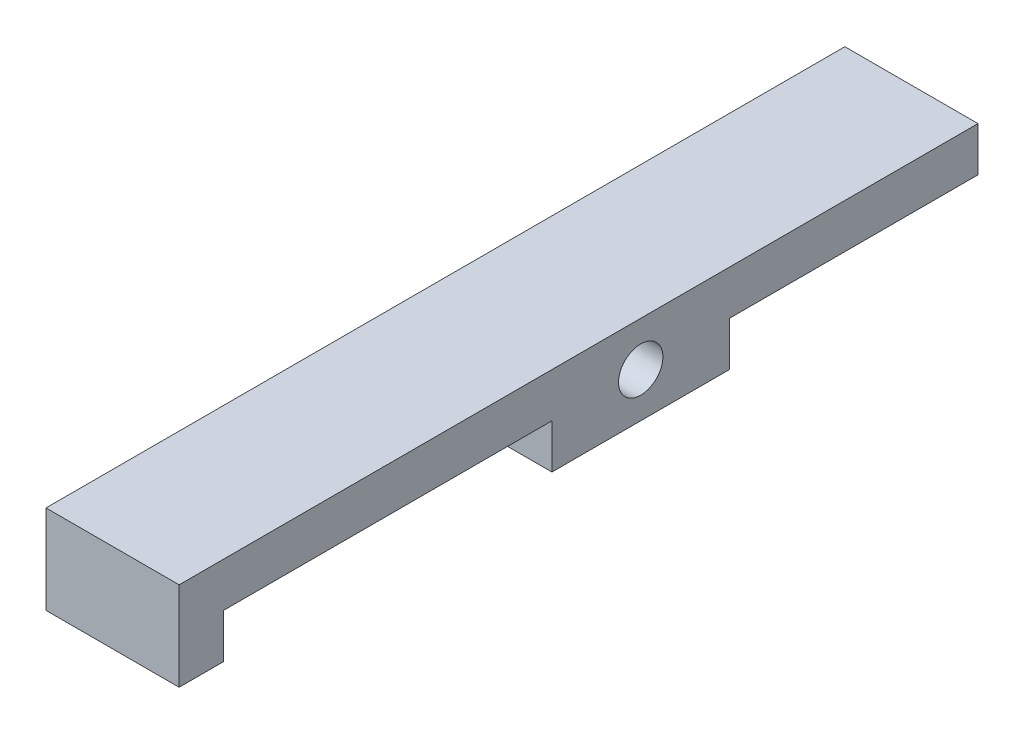
ISO-10303-21;
HEADER;
FILE_DESCRIPTION(('STEP AP214'),'2;1');
FILE_NAME('part.step','',(''),(''),'','','');
FILE_SCHEMA(('AUTOMOTIVE_DESIGN { 1 0 10303 214 1 1 1 1 }'));
ENDSEC;
DATA;
#1=APPLICATION_CONTEXT('core data for automotive mechanical design processes');
#2=APPLICATION_PROTOCOL_DEFINITION('international standard','automotive_design',2000,#1);
#3=PRODUCT_CONTEXT('',#1,'mechanical');
#4=PRODUCT('Part','Part','',(#3));
#5=PRODUCT_RELATED_PRODUCT_CATEGORY('part','',(#4));
#6=PRODUCT_DEFINITION_FORMATION('','',#4);
#7=PRODUCT_DEFINITION_CONTEXT('part definition',#1,'design');
#8=PRODUCT_DEFINITION('design','',#6,#7);
#9=PRODUCT_DEFINITION_SHAPE('','',#8);
#10=(LENGTH_UNIT() NAMED_UNIT(*) SI_UNIT(.MILLI.,.METRE.));
#11=(NAMED_UNIT(*) PLANE_ANGLE_UNIT() SI_UNIT($,.RADIAN.));
#12=(NAMED_UNIT(*) SI_UNIT($,.STERADIAN.) SOLID_ANGLE_UNIT());
#13=UNCERTAINTY_MEASURE_WITH_UNIT(LENGTH_MEASURE(1.E-05),#10,'distance_accuracy_value','');
#14=(GEOMETRIC_REPRESENTATION_CONTEXT(3) GLOBAL_UNCERTAINTY_ASSIGNED_CONTEXT((#13)) GLOBAL_UNIT_ASSIGNED_CONTEXT((#10,
#11,#12)) REPRESENTATION_CONTEXT('',''));
#15=CARTESIAN_POINT('',(0.,0.,0.));
#16=DIRECTION('',(0.,0.,1.));
#17=DIRECTION('',(1.,0.,0.));
#18=AXIS2_PLACEMENT_3D('',#15,#16,#17);
#19=CARTESIAN_POINT('',(9.525,0.,17.78));
#20=DIRECTION('',(0.,0.,-1.));
#21=DIRECTION('',(-1.,0.,0.));
#22=AXIS2_PLACEMENT_3D('',#19,#20,#21);
#23=PLANE('',#22);
#24=DIRECTION('',(0.,-1.,0.));
#25=VECTOR('',#24,1.);
#26=CARTESIAN_POINT('',(0.,0.,17.78));
#27=LINE('',#26,#25);
#28=CARTESIAN_POINT('',(0.,-1.58750000000001,17.78));
#29=VERTEX_POINT('',#28);
#30=CARTESIAN_POINT('',(0.,-4.76250000000001,17.78));
#31=VERTEX_POINT('',#30);
#32=EDGE_CURVE('E147',#29,#31,#27,.T.);
#33=ORIENTED_EDGE('',*,*,#32,.F.);
#34=DIRECTION('',(-1.,0.,0.));
#35=VECTOR('',#34,1.);
#36=CARTESIAN_POINT('',(9.525,-1.58750000000001,17.78));
#37=LINE('',#36,#35);
#38=CARTESIAN_POINT('',(9.525,-1.58750000000001,17.78));
#39=VERTEX_POINT('',#38);
#40=EDGE_CURVE('E11',#39,#29,#37,.T.);
#41=ORIENTED_EDGE('',*,*,#40,.F.);
#42=DIRECTION('',(0.,-1.,0.));
#43=VECTOR('',#42,1.);
#44=CARTESIAN_POINT('',(9.525,0.,17.78));
#45=LINE('',#44,#43);
#46=CARTESIAN_POINT('',(9.525,-4.76250000000001,17.78));
#47=VERTEX_POINT('',#46);
#48=EDGE_CURVE('E207',#39,#47,#45,.T.);
#49=ORIENTED_EDGE('',*,*,#48,.T.);
#50=DIRECTION('',(-1.,0.,0.));
#51=VECTOR('',#50,1.);
#52=CARTESIAN_POINT('',(9.525,-4.76250000000001,17.78));
#53=LINE('',#52,#51);
#54=EDGE_CURVE('E92',#47,#31,#53,.T.);
#55=ORIENTED_EDGE('',*,*,#54,.T.);
#56=EDGE_LOOP('',(#33,#41,#49,#55));
#57=FACE_BOUND('',#56,.T.);
#58=ADVANCED_FACE('F34',(#57),#23,.T.);
#59=CARTESIAN_POINT('',(9.525,-1.5875,0.));
#60=DIRECTION('',(0.,-1.,0.));
#61=DIRECTION('',(0.,0.,-1.));
#62=AXIS2_PLACEMENT_3D('',#59,#60,#61);
#63=PLANE('',#62);
#64=DIRECTION('',(0.,0.,1.));
#65=VECTOR('',#64,1.);
#66=CARTESIAN_POINT('',(0.,-1.5875,0.));
#67=LINE('',#66,#65);
#68=CARTESIAN_POINT('',(0.,-1.5875,0.));
#69=VERTEX_POINT('',#68);
#70=EDGE_CURVE('E149',#69,#29,#67,.T.);
#71=ORIENTED_EDGE('',*,*,#70,.F.);
#72=DIRECTION('',(-1.,0.,0.));
#73=VECTOR('',#72,1.);
#74=CARTESIAN_POINT('',(9.525,-1.5875,0.));
#75=LINE('',#74,#73);
#76=CARTESIAN_POINT('',(9.525,-1.5875,0.));
#77=VERTEX_POINT('',#76);
#78=EDGE_CURVE('E43',#77,#69,#75,.T.);
#79=ORIENTED_EDGE('',*,*,#78,.F.);
#80=DIRECTION('',(0.,0.,1.));
#81=VECTOR('',#80,1.);
#82=CARTESIAN_POINT('',(9.525,-1.5875,0.));
#83=LINE('',#82,#81);
#84=EDGE_CURVE('E203',#77,#39,#83,.T.);
#85=ORIENTED_EDGE('',*,*,#84,.T.);
#86=ORIENTED_EDGE('',*,*,#40,.T.);
#87=EDGE_LOOP('',(#71,#79,#85,#86));
#88=FACE_BOUND('',#87,.T.);
#89=ADVANCED_FACE('F192',(#88),#63,.T.);
#90=CARTESIAN_POINT('',(9.525,0.,0.));
#91=DIRECTION('',(0.,0.,-1.));
#92=DIRECTION('',(0.,1.,0.));
#93=AXIS2_PLACEMENT_3D('',#90,#91,#92);
#94=PLANE('',#93);
#95=DIRECTION('',(0.,-1.,0.));
#96=VECTOR('',#95,1.);
#97=CARTESIAN_POINT('',(0.,0.,0.));
#98=LINE('',#97,#96);
#99=CARTESIAN_POINT('',(0.,1.5875,0.));
#100=VERTEX_POINT('',#99);
#101=EDGE_CURVE('E152',#100,#69,#98,.T.);
#102=ORIENTED_EDGE('',*,*,#101,.F.);
#103=DIRECTION('',(-1.,0.,0.));
#104=VECTOR('',#103,1.);
#105=CARTESIAN_POINT('',(9.525,1.5875,0.));
#106=LINE('',#105,#104);
#107=CARTESIAN_POINT('',(9.525,1.5875,0.));
#108=VERTEX_POINT('',#107);
#109=EDGE_CURVE('E181',#108,#100,#106,.T.);
#110=ORIENTED_EDGE('',*,*,#109,.F.);
#111=DIRECTION('',(0.,-1.,0.));
#112=VECTOR('',#111,1.);
#113=CARTESIAN_POINT('',(9.525,0.,0.));
#114=LINE('',#113,#112);
#115=EDGE_CURVE('E188',#108,#77,#114,.T.);
#116=ORIENTED_EDGE('',*,*,#115,.T.);
#117=ORIENTED_EDGE('',*,*,#78,.T.);
#118=EDGE_LOOP('',(#102,#110,#116,#117));
#119=FACE_BOUND('',#118,.T.);
#120=ADVANCED_FACE('F186',(#119),#94,.T.);
#121=CARTESIAN_POINT('',(9.525,1.5875,0.));
#122=DIRECTION('',(0.,1.,0.));
#123=DIRECTION('',(0.,0.,1.));
#124=AXIS2_PLACEMENT_3D('',#121,#122,#123);
#125=PLANE('',#124);
#126=DIRECTION('',(0.,0.,-1.));
#127=VECTOR('',#126,1.);
#128=CARTESIAN_POINT('',(0.,1.5875,0.));
#129=LINE('',#128,#127);
#130=CARTESIAN_POINT('',(0.,1.58749999999999,57.15));
#131=VERTEX_POINT('',#130);
#132=EDGE_CURVE('E155',#131,#100,#129,.T.);
#133=ORIENTED_EDGE('',*,*,#132,.F.);
#134=DIRECTION('',(-1.,0.,0.));
#135=VECTOR('',#134,1.);
#136=CARTESIAN_POINT('',(9.525,1.58749999999999,57.15));
#137=LINE('',#136,#135);
#138=CARTESIAN_POINT('',(9.525,1.58749999999999,57.15));
#139=VERTEX_POINT('',#138);
#140=EDGE_CURVE('E179',#139,#131,#137,.T.);
#141=ORIENTED_EDGE('',*,*,#140,.F.);
#142=DIRECTION('',(0.,0.,-1.));
#143=VECTOR('',#142,1.);
#144=CARTESIAN_POINT('',(9.525,1.5875,0.));
#145=LINE('',#144,#143);
#146=EDGE_CURVE('E200',#139,#108,#145,.T.);
#147=ORIENTED_EDGE('',*,*,#146,.T.);
#148=ORIENTED_EDGE('',*,*,#109,.T.);
#149=EDGE_LOOP('',(#133,#141,#147,#148));
#150=FACE_BOUND('',#149,.T.);
#151=ADVANCED_FACE('F197',(#150),#125,.T.);
#152=CARTESIAN_POINT('',(9.525,0.,57.15));
#153=DIRECTION('',(0.,0.,1.));
#154=DIRECTION('',(1.,0.,0.));
#155=AXIS2_PLACEMENT_3D('',#152,#153,#154);
#156=PLANE('',#155);
#157=DIRECTION('',(0.,1.,0.));
#158=VECTOR('',#157,1.);
#159=CARTESIAN_POINT('',(0.,0.,57.15));
#160=LINE('',#159,#158);
#161=CARTESIAN_POINT('',(0.,-4.76250000000001,57.15));
#162=VERTEX_POINT('',#161);
#163=EDGE_CURVE('E158',#162,#131,#160,.T.);
#164=ORIENTED_EDGE('',*,*,#163,.F.);
#165=DIRECTION('',(-1.,0.,0.));
#166=VECTOR('',#165,1.);
#167=CARTESIAN_POINT('',(9.525,-4.76250000000001,57.15));
#168=LINE('',#167,#166);
#169=CARTESIAN_POINT('',(9.525,-4.76250000000001,57.15));
#170=VERTEX_POINT('',#169);
#171=EDGE_CURVE('E177',#170,#162,#168,.T.);
#172=ORIENTED_EDGE('',*,*,#171,.F.);
#173=DIRECTION('',(0.,1.,0.));
#174=VECTOR('',#173,1.);
#175=CARTESIAN_POINT('',(9.525,0.,57.15));
#176=LINE('',#175,#174);
#177=EDGE_CURVE('E205',#170,#139,#176,.T.);
#178=ORIENTED_EDGE('',*,*,#177,.T.);
#179=ORIENTED_EDGE('',*,*,#140,.T.);
#180=EDGE_LOOP('',(#164,#172,#178,#179));
#181=FACE_BOUND('',#180,.T.);
#182=ADVANCED_FACE('F225',(#181),#156,.T.);
#183=CARTESIAN_POINT('',(9.525,-4.76249999999999,0.));
#184=DIRECTION('',(0.,-1.,0.));
#185=DIRECTION('',(0.,0.,-1.));
#186=AXIS2_PLACEMENT_3D('',#183,#184,#185);
#187=PLANE('',#186);
#188=DIRECTION('',(0.,0.,1.));
#189=VECTOR('',#188,1.);
#190=CARTESIAN_POINT('',(0.,-4.76249999999999,0.));
#191=LINE('',#190,#189);
#192=CARTESIAN_POINT('',(0.,-4.76250000000001,53.975));
#193=VERTEX_POINT('',#192);
#194=EDGE_CURVE('E161',#193,#162,#191,.T.);
#195=ORIENTED_EDGE('',*,*,#194,.F.);
#196=DIRECTION('',(-1.,0.,0.));
#197=VECTOR('',#196,1.);
#198=CARTESIAN_POINT('',(9.525,-4.76250000000001,53.975));
#199=LINE('',#198,#197);
#200=CARTESIAN_POINT('',(9.525,-4.76250000000001,53.975));
#201=VERTEX_POINT('',#200);
#202=EDGE_CURVE('E175',#201,#193,#199,.T.);
#203=ORIENTED_EDGE('',*,*,#202,.F.);
#204=DIRECTION('',(0.,0.,1.));
#205=VECTOR('',#204,1.);
#206=CARTESIAN_POINT('',(9.525,-4.76249999999999,0.));
#207=LINE('',#206,#205);
#208=EDGE_CURVE('E139',#201,#170,#207,.T.);
#209=ORIENTED_EDGE('',*,*,#208,.T.);
#210=ORIENTED_EDGE('',*,*,#171,.T.);
#211=EDGE_LOOP('',(#195,#203,#209,#210));
#212=FACE_BOUND('',#211,.T.);
#213=ADVANCED_FACE('F214',(#212),#187,.T.);
#214=CARTESIAN_POINT('',(9.525,0.,53.975));
#215=DIRECTION('',(0.,0.,-1.));
#216=DIRECTION('',(-1.,0.,0.));
#217=AXIS2_PLACEMENT_3D('',#214,#215,#216);
#218=PLANE('',#217);
#219=DIRECTION('',(0.,-1.,0.));
#220=VECTOR('',#219,1.);
#221=CARTESIAN_POINT('',(0.,0.,53.975));
#222=LINE('',#221,#220);
#223=CARTESIAN_POINT('',(0.,-1.58750000000001,53.975));
#224=VERTEX_POINT('',#223);
#225=EDGE_CURVE('E164',#224,#193,#222,.T.);
#226=ORIENTED_EDGE('',*,*,#225,.F.);
#227=DIRECTION('',(-1.,0.,0.));
#228=VECTOR('',#227,1.);
#229=CARTESIAN_POINT('',(9.525,-1.58750000000001,53.975));
#230=LINE('',#229,#228);
#231=CARTESIAN_POINT('',(9.525,-1.58750000000001,53.975));
#232=VERTEX_POINT('',#231);
#233=EDGE_CURVE('E126',#232,#224,#230,.T.);
#234=ORIENTED_EDGE('',*,*,#233,.F.);
#235=DIRECTION('',(0.,-1.,0.));
#236=VECTOR('',#235,1.);
#237=CARTESIAN_POINT('',(9.525,0.,53.975));
#238=LINE('',#237,#236);
#239=EDGE_CURVE('E137',#232,#201,#238,.T.);
#240=ORIENTED_EDGE('',*,*,#239,.T.);
#241=ORIENTED_EDGE('',*,*,#202,.T.);
#242=EDGE_LOOP('',(#226,#234,#240,#241));
#243=FACE_BOUND('',#242,.T.);
#244=ADVANCED_FACE('F217',(#243),#218,.T.);
#245=CARTESIAN_POINT('',(9.525,-1.58750000000001,0.));
#246=DIRECTION('',(0.,-1.,0.));
#247=DIRECTION('',(0.,0.,-1.));
#248=AXIS2_PLACEMENT_3D('',#245,#246,#247);
#249=PLANE('',#248);
#250=DIRECTION('',(0.,0.,1.));
#251=VECTOR('',#250,1.);
#252=CARTESIAN_POINT('',(0.,-1.58750000000001,0.));
#253=LINE('',#252,#251);
#254=CARTESIAN_POINT('',(0.,-1.58750000000001,30.48));
#255=VERTEX_POINT('',#254);
#256=EDGE_CURVE('E123',#255,#224,#253,.T.);
#257=ORIENTED_EDGE('',*,*,#256,.F.);
#258=DIRECTION('',(-1.,0.,0.));
#259=VECTOR('',#258,1.);
#260=CARTESIAN_POINT('',(9.525,-1.58750000000001,30.48));
#261=LINE('',#260,#259);
#262=CARTESIAN_POINT('',(9.525,-1.58750000000001,30.48));
#263=VERTEX_POINT('',#262);
#264=EDGE_CURVE('E117',#263,#255,#261,.T.);
#265=ORIENTED_EDGE('',*,*,#264,.F.);
#266=DIRECTION('',(0.,0.,1.));
#267=VECTOR('',#266,1.);
#268=CARTESIAN_POINT('',(9.525,-1.58750000000001,0.));
#269=LINE('',#268,#267);
#270=EDGE_CURVE('E121',#263,#232,#269,.T.);
#271=ORIENTED_EDGE('',*,*,#270,.T.);
#272=ORIENTED_EDGE('',*,*,#233,.T.);
#273=EDGE_LOOP('',(#257,#265,#271,#272));
#274=FACE_BOUND('',#273,.T.);
#275=ADVANCED_FACE('F119',(#274),#249,.T.);
#276=CARTESIAN_POINT('',(9.525,0.,30.48));
#277=DIRECTION('',(0.,0.,-1.));
#278=DIRECTION('',(-1.,0.,0.));
#279=AXIS2_PLACEMENT_3D('',#276,#277,#278);
#280=PLANE('',#279);
#281=DIRECTION('',(0.,-1.,0.));
#282=VECTOR('',#281,1.);
#283=CARTESIAN_POINT('',(0.,0.,30.48));
#284=LINE('',#283,#282);
#285=CARTESIAN_POINT('',(0.,-4.76250000000001,30.48));
#286=VERTEX_POINT('',#285);
#287=EDGE_CURVE('E168',#255,#286,#284,.T.);
#288=ORIENTED_EDGE('',*,*,#287,.T.);
#289=DIRECTION('',(-1.,0.,0.));
#290=VECTOR('',#289,1.);
#291=CARTESIAN_POINT('',(9.525,-4.76250000000001,30.48));
#292=LINE('',#291,#290);
#293=CARTESIAN_POINT('',(9.525,-4.76250000000001,30.48));
#294=VERTEX_POINT('',#293);
#295=EDGE_CURVE('E127',#294,#286,#292,.T.);
#296=ORIENTED_EDGE('',*,*,#295,.F.);
#297=DIRECTION('',(0.,-1.,0.));
#298=VECTOR('',#297,1.);
#299=CARTESIAN_POINT('',(9.525,0.,30.48));
#300=LINE('',#299,#298);
#301=EDGE_CURVE('E130',#263,#294,#300,.T.);
#302=ORIENTED_EDGE('',*,*,#301,.F.);
#303=ORIENTED_EDGE('',*,*,#264,.T.);
#304=EDGE_LOOP('',(#288,#296,#302,#303));
#305=FACE_BOUND('',#304,.T.);
#306=ADVANCED_FACE('F131',(#305),#280,.F.);
#307=CARTESIAN_POINT('',(9.525,-1.58750000000001,24.13));
#308=DIRECTION('',(-1.,0.,0.));
#309=DIRECTION('',(0.,0.,1.));
#310=AXIS2_PLACEMENT_3D('',#307,#308,#309);
#311=CYLINDRICAL_SURFACE('',#310,1.5875);
#312=CARTESIAN_POINT('',(9.525,-1.58750000000001,24.13));
#313=DIRECTION('',(1.,0.,0.));
#314=DIRECTION('',(0.,0.,-1.));
#315=AXIS2_PLACEMENT_3D('',#312,#313,#314);
#316=CIRCLE('',#315,1.5875);
#317=CARTESIAN_POINT('',(9.525,-1.58750000000001,22.5425));
#318=VERTEX_POINT('',#317);
#319=EDGE_CURVE('E171',#318,#318,#316,.T.);
#320=ORIENTED_EDGE('',*,*,#319,.T.);
#321=EDGE_LOOP('',(#320));
#322=FACE_BOUND('',#321,.T.);
#323=CARTESIAN_POINT('',(0.,-1.58750000000001,24.13));
#324=DIRECTION('',(1.,0.,0.));
#325=DIRECTION('',(0.,0.,-1.));
#326=AXIS2_PLACEMENT_3D('',#323,#324,#325);
#327=CIRCLE('',#326,1.5875);
#328=CARTESIAN_POINT('',(0.,-1.58750000000001,22.5425));
#329=VERTEX_POINT('',#328);
#330=EDGE_CURVE('E144',#329,#329,#327,.T.);
#331=ORIENTED_EDGE('',*,*,#330,.F.);
#332=EDGE_LOOP('',(#331));
#333=FACE_BOUND('',#332,.T.);
#334=ADVANCED_FACE('F36',(#322,#333),#311,.F.);
#335=CARTESIAN_POINT('',(9.525,-4.76250000000001,0.));
#336=DIRECTION('',(0.,1.,0.));
#337=DIRECTION('',(0.,0.,1.));
#338=AXIS2_PLACEMENT_3D('',#335,#336,#337);
#339=PLANE('',#338);
#340=DIRECTION('',(0.,0.,-1.));
#341=VECTOR('',#340,1.);
#342=CARTESIAN_POINT('',(0.,-4.76250000000001,0.));
#343=LINE('',#342,#341);
#344=EDGE_CURVE('E85',#286,#31,#343,.T.);
#345=ORIENTED_EDGE('',*,*,#344,.T.);
#346=ORIENTED_EDGE('',*,*,#54,.F.);
#347=DIRECTION('',(0.,0.,-1.));
#348=VECTOR('',#347,1.);
#349=CARTESIAN_POINT('',(9.525,-4.76250000000001,0.));
#350=LINE('',#349,#348);
#351=EDGE_CURVE('E51',#294,#47,#350,.T.);
#352=ORIENTED_EDGE('',*,*,#351,.F.);
#353=ORIENTED_EDGE('',*,*,#295,.T.);
#354=EDGE_LOOP('',(#345,#346,#352,#353));
#355=FACE_BOUND('',#354,.T.);
#356=ADVANCED_FACE('F274',(#355),#339,.F.);
#357=CARTESIAN_POINT('',(9.525,0.,0.));
#358=DIRECTION('',(1.,0.,0.));
#359=DIRECTION('',(0.,0.,-1.));
#360=AXIS2_PLACEMENT_3D('',#357,#358,#359);
#361=PLANE('',#360);
#362=ORIENTED_EDGE('',*,*,#319,.F.);
#363=EDGE_LOOP('',(#362));
#364=FACE_BOUND('',#363,.T.);
#365=ORIENTED_EDGE('',*,*,#48,.F.);
#366=ORIENTED_EDGE('',*,*,#84,.F.);
#367=ORIENTED_EDGE('',*,*,#115,.F.);
#368=ORIENTED_EDGE('',*,*,#146,.F.);
#369=ORIENTED_EDGE('',*,*,#177,.F.);
#370=ORIENTED_EDGE('',*,*,#208,.F.);
#371=ORIENTED_EDGE('',*,*,#239,.F.);
#372=ORIENTED_EDGE('',*,*,#270,.F.);
#373=ORIENTED_EDGE('',*,*,#301,.T.);
#374=ORIENTED_EDGE('',*,*,#351,.T.);
#375=EDGE_LOOP('',(#365,#366,#367,#368,#369,#370,#371,#372,#373,#374));
#376=FACE_BOUND('',#375,.T.);
#377=ADVANCED_FACE('F134',(#364,#376),#361,.T.);
#378=CARTESIAN_POINT('',(0.,0.,0.));
#379=DIRECTION('',(1.,0.,0.));
#380=DIRECTION('',(0.,0.,-1.));
#381=AXIS2_PLACEMENT_3D('',#378,#379,#380);
#382=PLANE('',#381);
#383=ORIENTED_EDGE('',*,*,#330,.T.);
#384=EDGE_LOOP('',(#383));
#385=FACE_BOUND('',#384,.T.);
#386=ORIENTED_EDGE('',*,*,#32,.T.);
#387=ORIENTED_EDGE('',*,*,#344,.F.);
#388=ORIENTED_EDGE('',*,*,#287,.F.);
#389=ORIENTED_EDGE('',*,*,#256,.T.);
#390=ORIENTED_EDGE('',*,*,#225,.T.);
#391=ORIENTED_EDGE('',*,*,#194,.T.);
#392=ORIENTED_EDGE('',*,*,#163,.T.);
#393=ORIENTED_EDGE('',*,*,#132,.T.);
#394=ORIENTED_EDGE('',*,*,#101,.T.);
#395=ORIENTED_EDGE('',*,*,#70,.T.);
#396=EDGE_LOOP('',(#386,#387,#388,#389,#390,#391,#392,#393,#394,#395));
#397=FACE_BOUND('',#396,.T.);
#398=ADVANCED_FACE('F193',(#385,#397),#382,.F.);
#399=CLOSED_SHELL('',(#58,#89,#120,#151,#182,#213,#244,#275,#306,#334,#356,#377,#398));
#400=MANIFOLD_SOLID_BREP('B2',#399);
#401=ADVANCED_BREP_SHAPE_REPRESENTATION('',(#18,#400),#14);
#402=SHAPE_DEFINITION_REPRESENTATION(#9,#401);
ENDSEC;
END-ISO-10303-21;
